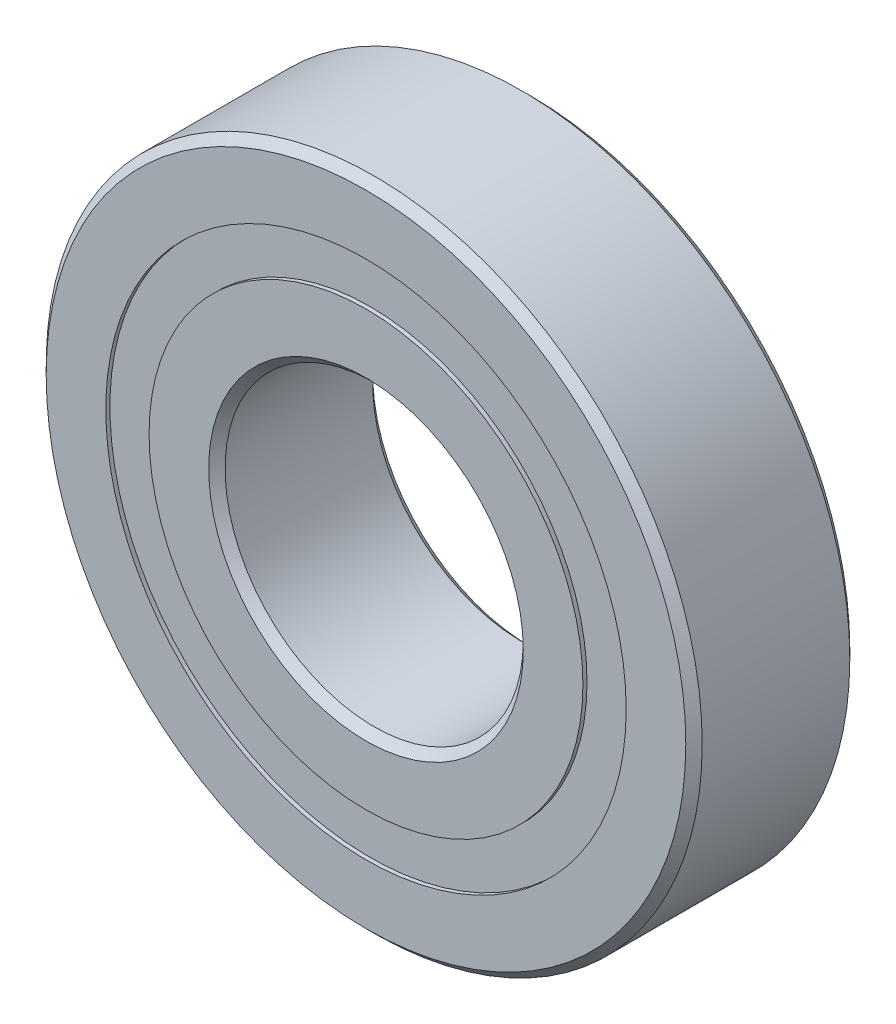
ISO-10303-21;
HEADER;
FILE_DESCRIPTION(('STEP AP214'),'2;1');
FILE_NAME('part.step','',(''),(''),'','','');
FILE_SCHEMA(('AUTOMOTIVE_DESIGN { 1 0 10303 214 1 1 1 1 }'));
ENDSEC;
DATA;
#1=APPLICATION_CONTEXT('core data for automotive mechanical design processes');
#2=APPLICATION_PROTOCOL_DEFINITION('international standard','automotive_design',2000,#1);
#3=PRODUCT_CONTEXT('',#1,'mechanical');
#4=PRODUCT('Part','Part','',(#3));
#5=PRODUCT_RELATED_PRODUCT_CATEGORY('part','',(#4));
#6=PRODUCT_DEFINITION_FORMATION('','',#4);
#7=PRODUCT_DEFINITION_CONTEXT('part definition',#1,'design');
#8=PRODUCT_DEFINITION('design','',#6,#7);
#9=PRODUCT_DEFINITION_SHAPE('','',#8);
#10=(LENGTH_UNIT() NAMED_UNIT(*) SI_UNIT(.MILLI.,.METRE.));
#11=(NAMED_UNIT(*) PLANE_ANGLE_UNIT() SI_UNIT($,.RADIAN.));
#12=(NAMED_UNIT(*) SI_UNIT($,.STERADIAN.) SOLID_ANGLE_UNIT());
#13=UNCERTAINTY_MEASURE_WITH_UNIT(LENGTH_MEASURE(1.E-05),#10,'distance_accuracy_value','');
#14=(GEOMETRIC_REPRESENTATION_CONTEXT(3) GLOBAL_UNCERTAINTY_ASSIGNED_CONTEXT((#13)) GLOBAL_UNIT_ASSIGNED_CONTEXT((#10,
#11,#12)) REPRESENTATION_CONTEXT('',''));
#15=CARTESIAN_POINT('',(0.,0.,0.));
#16=DIRECTION('',(0.,0.,1.));
#17=DIRECTION('',(1.,0.,0.));
#18=AXIS2_PLACEMENT_3D('',#15,#16,#17);
#19=CARTESIAN_POINT('',(0.,13.8513736263736,-4.14734375000003));
#20=DIRECTION('',(0.,0.,1.));
#21=DIRECTION('',(1.,0.,0.));
#22=AXIS2_PLACEMENT_3D('',#19,#20,#21);
#23=PLANE('',#22);
#24=CARTESIAN_POINT('',(0.,0.,-4.14734375000003));
#25=DIRECTION('',(0.,0.,1.));
#26=DIRECTION('',(1.,0.,0.));
#27=AXIS2_PLACEMENT_3D('',#24,#25,#26);
#28=CIRCLE('',#27,13.8513736263736);
#29=CARTESIAN_POINT('',(13.8513736263736,0.,-4.14734375000003));
#30=VERTEX_POINT('',#29);
#31=EDGE_CURVE('E63',#30,#30,#28,.T.);
#32=ORIENTED_EDGE('',*,*,#31,.F.);
#33=EDGE_LOOP('',(#32));
#34=FACE_BOUND('',#33,.T.);
#35=CARTESIAN_POINT('',(0.,0.,-4.14734375000003));
#36=DIRECTION('',(0.,0.,1.));
#37=DIRECTION('',(1.,0.,0.));
#38=AXIS2_PLACEMENT_3D('',#35,#36,#37);
#39=CIRCLE('',#38,11.5486263736264);
#40=CARTESIAN_POINT('',(11.5486263736264,0.,-4.14734375000003));
#41=VERTEX_POINT('',#40);
#42=EDGE_CURVE('E11',#41,#41,#39,.T.);
#43=ORIENTED_EDGE('',*,*,#42,.T.);
#44=EDGE_LOOP('',(#43));
#45=FACE_BOUND('',#44,.T.);
#46=ADVANCED_FACE('F49',(#34,#45),#23,.F.);
#47=CARTESIAN_POINT('',(0.,0.,4.36562500000004));
#48=DIRECTION('',(0.,0.,1.));
#49=DIRECTION('',(1.,0.,0.));
#50=AXIS2_PLACEMENT_3D('',#47,#48,#49);
#51=CYLINDRICAL_SURFACE('',#50,11.5486263736264);
#52=ORIENTED_EDGE('',*,*,#42,.F.);
#53=EDGE_LOOP('',(#52));
#54=FACE_BOUND('',#53,.T.);
#55=CARTESIAN_POINT('',(0.,0.,-2.25617798111033));
#56=DIRECTION('',(0.,0.,1.));
#57=DIRECTION('',(1.,0.,0.));
#58=AXIS2_PLACEMENT_3D('',#55,#56,#57);
#59=CIRCLE('',#58,11.5486263736264);
#60=CARTESIAN_POINT('',(11.5486263736264,0.,-2.25617798111033));
#61=VERTEX_POINT('',#60);
#62=EDGE_CURVE('E55',#61,#61,#59,.T.);
#63=ORIENTED_EDGE('',*,*,#62,.T.);
#64=EDGE_LOOP('',(#63));
#65=FACE_BOUND('',#64,.T.);
#66=ADVANCED_FACE('F72',(#54,#65),#51,.F.);
#67=CARTESIAN_POINT('',(0.,13.8513736263736,-2.25617798111033));
#68=DIRECTION('',(0.,0.,-1.));
#69=DIRECTION('',(-1.,0.,0.));
#70=AXIS2_PLACEMENT_3D('',#67,#68,#69);
#71=PLANE('',#70);
#72=ORIENTED_EDGE('',*,*,#62,.F.);
#73=EDGE_LOOP('',(#72));
#74=FACE_BOUND('',#73,.T.);
#75=CARTESIAN_POINT('',(0.,0.,-2.25617798111033));
#76=DIRECTION('',(0.,0.,1.));
#77=DIRECTION('',(1.,0.,0.));
#78=AXIS2_PLACEMENT_3D('',#75,#76,#77);
#79=CIRCLE('',#78,13.8513736263736);
#80=CARTESIAN_POINT('',(13.8513736263736,0.,-2.25617798111033));
#81=VERTEX_POINT('',#80);
#82=EDGE_CURVE('E59',#81,#81,#79,.T.);
#83=ORIENTED_EDGE('',*,*,#82,.T.);
#84=EDGE_LOOP('',(#83));
#85=FACE_BOUND('',#84,.T.);
#86=ADVANCED_FACE('F76',(#74,#85),#71,.F.);
#87=CARTESIAN_POINT('',(0.,0.,4.36562500000004));
#88=DIRECTION('',(0.,0.,1.));
#89=DIRECTION('',(1.,0.,0.));
#90=AXIS2_PLACEMENT_3D('',#87,#88,#89);
#91=CYLINDRICAL_SURFACE('',#90,13.8513736263736);
#92=ORIENTED_EDGE('',*,*,#82,.F.);
#93=EDGE_LOOP('',(#92));
#94=FACE_BOUND('',#93,.T.);
#95=ORIENTED_EDGE('',*,*,#31,.T.);
#96=EDGE_LOOP('',(#95));
#97=FACE_BOUND('',#96,.T.);
#98=ADVANCED_FACE('F69',(#94,#97),#91,.T.);
#99=CLOSED_SHELL('',(#46,#66,#86,#98));
#100=MANIFOLD_SOLID_BREP('B2',#99);
#101=CARTESIAN_POINT('',(0.,13.8513736263736,4.14734375000003));
#102=DIRECTION('',(0.,0.,-1.));
#103=DIRECTION('',(-1.,0.,0.));
#104=AXIS2_PLACEMENT_3D('',#101,#102,#103);
#105=PLANE('',#104);
#106=CARTESIAN_POINT('',(0.,0.,4.14734375000003));
#107=DIRECTION('',(0.,0.,1.));
#108=DIRECTION('',(1.,0.,0.));
#109=AXIS2_PLACEMENT_3D('',#106,#107,#108);
#110=CIRCLE('',#109,11.5486263736264);
#111=CARTESIAN_POINT('',(11.5486263736264,0.,4.14734375000003));
#112=VERTEX_POINT('',#111);
#113=EDGE_CURVE('E48',#112,#112,#110,.T.);
#114=ORIENTED_EDGE('',*,*,#113,.F.);
#115=EDGE_LOOP('',(#114));
#116=FACE_BOUND('',#115,.T.);
#117=CARTESIAN_POINT('',(0.,0.,4.14734375000003));
#118=DIRECTION('',(0.,0.,1.));
#119=DIRECTION('',(1.,0.,0.));
#120=AXIS2_PLACEMENT_3D('',#117,#118,#119);
#121=CIRCLE('',#120,13.8513736263736);
#122=CARTESIAN_POINT('',(13.8513736263736,0.,4.14734375000003));
#123=VERTEX_POINT('',#122);
#124=EDGE_CURVE('E128',#123,#123,#121,.T.);
#125=ORIENTED_EDGE('',*,*,#124,.T.);
#126=EDGE_LOOP('',(#125));
#127=FACE_BOUND('',#126,.T.);
#128=ADVANCED_FACE('F114',(#116,#127),#105,.F.);
#129=CARTESIAN_POINT('',(0.,0.,4.36562500000004));
#130=DIRECTION('',(0.,0.,1.));
#131=DIRECTION('',(1.,0.,0.));
#132=AXIS2_PLACEMENT_3D('',#129,#130,#131);
#133=CYLINDRICAL_SURFACE('',#132,11.5486263736264);
#134=CARTESIAN_POINT('',(0.,0.,2.25617798111033));
#135=DIRECTION('',(0.,0.,1.));
#136=DIRECTION('',(1.,0.,0.));
#137=AXIS2_PLACEMENT_3D('',#134,#135,#136);
#138=CIRCLE('',#137,11.5486263736264);
#139=CARTESIAN_POINT('',(11.5486263736264,0.,2.25617798111033));
#140=VERTEX_POINT('',#139);
#141=EDGE_CURVE('E120',#140,#140,#138,.T.);
#142=ORIENTED_EDGE('',*,*,#141,.F.);
#143=EDGE_LOOP('',(#142));
#144=FACE_BOUND('',#143,.T.);
#145=ORIENTED_EDGE('',*,*,#113,.T.);
#146=EDGE_LOOP('',(#145));
#147=FACE_BOUND('',#146,.T.);
#148=ADVANCED_FACE('F143',(#144,#147),#133,.F.);
#149=CARTESIAN_POINT('',(0.,13.8513736263736,2.25617798111033));
#150=DIRECTION('',(0.,0.,1.));
#151=DIRECTION('',(1.,0.,0.));
#152=AXIS2_PLACEMENT_3D('',#149,#150,#151);
#153=PLANE('',#152);
#154=CARTESIAN_POINT('',(0.,0.,2.25617798111033));
#155=DIRECTION('',(0.,0.,1.));
#156=DIRECTION('',(1.,0.,0.));
#157=AXIS2_PLACEMENT_3D('',#154,#155,#156);
#158=CIRCLE('',#157,13.8513736263736);
#159=CARTESIAN_POINT('',(13.8513736263736,0.,2.25617798111033));
#160=VERTEX_POINT('',#159);
#161=EDGE_CURVE('E124',#160,#160,#158,.T.);
#162=ORIENTED_EDGE('',*,*,#161,.F.);
#163=EDGE_LOOP('',(#162));
#164=FACE_BOUND('',#163,.T.);
#165=ORIENTED_EDGE('',*,*,#141,.T.);
#166=EDGE_LOOP('',(#165));
#167=FACE_BOUND('',#166,.T.);
#168=ADVANCED_FACE('F138',(#164,#167),#153,.F.);
#169=CARTESIAN_POINT('',(0.,0.,4.36562500000004));
#170=DIRECTION('',(0.,0.,1.));
#171=DIRECTION('',(1.,0.,0.));
#172=AXIS2_PLACEMENT_3D('',#169,#170,#171);
#173=CYLINDRICAL_SURFACE('',#172,13.8513736263736);
#174=ORIENTED_EDGE('',*,*,#124,.F.);
#175=EDGE_LOOP('',(#174));
#176=FACE_BOUND('',#175,.T.);
#177=ORIENTED_EDGE('',*,*,#161,.T.);
#178=EDGE_LOOP('',(#177));
#179=FACE_BOUND('',#178,.T.);
#180=ADVANCED_FACE('F135',(#176,#179),#173,.T.);
#181=CLOSED_SHELL('',(#128,#148,#168,#180));
#182=MANIFOLD_SOLID_BREP('B6',#181);
#183=CARTESIAN_POINT('',(-7.46487270411428,10.2745158285619,0.));
#184=DIRECTION('',(0.,0.,1.));
#185=DIRECTION('',(-0.587785252292463,0.809016994374956,0.));
#186=AXIS2_PLACEMENT_3D('',#183,#184,#185);
#187=SPHERICAL_SURFACE('',#186,2.25617798111032);
#188=CARTESIAN_POINT('',(-7.46487270411428,10.2745158285619,2.25617798111032));
#189=VERTEX_POINT('',#188);
#190=VERTEX_LOOP('',#189);
#191=FACE_BOUND('',#190,.T.);
#192=ADVANCED_FACE('F173',(#191),#187,.T.);
#193=CLOSED_SHELL('',(#192));
#194=MANIFOLD_SOLID_BREP('B43',#193);
#195=CARTESIAN_POINT('',(-12.0784177569484,3.92451582856197,0.));
#196=DIRECTION('',(0.,0.,1.));
#197=DIRECTION('',(-0.951056516295151,0.309016994374959,0.));
#198=AXIS2_PLACEMENT_3D('',#195,#196,#197);
#199=SPHERICAL_SURFACE('',#198,2.25617798111032);
#200=CARTESIAN_POINT('',(-12.0784177569484,3.92451582856197,2.25617798111032));
#201=VERTEX_POINT('',#200);
#202=VERTEX_LOOP('',#201);
#203=FACE_BOUND('',#202,.T.);
#204=ADVANCED_FACE('F191',(#203),#199,.T.);
#205=CLOSED_SHELL('',(#204));
#206=MANIFOLD_SOLID_BREP('B110',#205);
#207=CARTESIAN_POINT('',(-12.0784177569485,-3.92451582856172,0.));
#208=DIRECTION('',(0.,0.,1.));
#209=DIRECTION('',(-0.951056516295158,-0.309016994374939,0.));
#210=AXIS2_PLACEMENT_3D('',#207,#208,#209);
#211=SPHERICAL_SURFACE('',#210,2.25617798111032);
#212=CARTESIAN_POINT('',(-12.0784177569485,-3.92451582856172,2.25617798111032));
#213=VERTEX_POINT('',#212);
#214=VERTEX_LOOP('',#213);
#215=FACE_BOUND('',#214,.T.);
#216=ADVANCED_FACE('F209',(#215),#211,.T.);
#217=CLOSED_SHELL('',(#216));
#218=MANIFOLD_SOLID_BREP('B169',#217);
#219=CARTESIAN_POINT('',(-7.4648727041145,-10.2745158285618,0.));
#220=DIRECTION('',(0.,0.,1.));
#221=DIRECTION('',(-0.587785252292481,-0.809016994374944,0.));
#222=AXIS2_PLACEMENT_3D('',#219,#220,#221);
#223=SPHERICAL_SURFACE('',#222,2.25617798111032);
#224=CARTESIAN_POINT('',(-7.4648727041145,-10.2745158285618,2.25617798111032));
#225=VERTEX_POINT('',#224);
#226=VERTEX_LOOP('',#225);
#227=FACE_BOUND('',#226,.T.);
#228=ADVANCED_FACE('F227',(#227),#223,.T.);
#229=CLOSED_SHELL('',(#228));
#230=MANIFOLD_SOLID_BREP('B187',#229);
#231=CARTESIAN_POINT('',(-1.11022302462516E-13,-12.7,0.));
#232=DIRECTION('',(0.,0.,1.));
#233=DIRECTION('',(0.,-1.,0.));
#234=AXIS2_PLACEMENT_3D('',#231,#232,#233);
#235=SPHERICAL_SURFACE('',#234,2.25617798111032);
#236=CARTESIAN_POINT('',(-1.11022302462516E-13,-12.7,2.25617798111032));
#237=VERTEX_POINT('',#236);
#238=VERTEX_LOOP('',#237);
#239=FACE_BOUND('',#238,.T.);
#240=ADVANCED_FACE('F245',(#239),#235,.T.);
#241=CLOSED_SHELL('',(#240));
#242=MANIFOLD_SOLID_BREP('B205',#241);
#243=CARTESIAN_POINT('',(7.46487270411433,-10.2745158285619,0.));
#244=DIRECTION('',(0.,0.,1.));
#245=DIRECTION('',(0.587785252292469,-0.809016994374952,0.));
#246=AXIS2_PLACEMENT_3D('',#243,#244,#245);
#247=SPHERICAL_SURFACE('',#246,2.25617798111032);
#248=CARTESIAN_POINT('',(7.46487270411433,-10.2745158285619,2.25617798111032));
#249=VERTEX_POINT('',#248);
#250=VERTEX_LOOP('',#249);
#251=FACE_BOUND('',#250,.T.);
#252=ADVANCED_FACE('F263',(#251),#247,.T.);
#253=CLOSED_SHELL('',(#252));
#254=MANIFOLD_SOLID_BREP('B223',#253);
#255=CARTESIAN_POINT('',(12.0784177569485,-3.92451582856188,0.));
#256=DIRECTION('',(0.,0.,1.));
#257=DIRECTION('',(0.951056516295154,-0.309016994374952,0.));
#258=AXIS2_PLACEMENT_3D('',#255,#256,#257);
#259=SPHERICAL_SURFACE('',#258,2.25617798111032);
#260=CARTESIAN_POINT('',(12.0784177569485,-3.92451582856188,2.25617798111032));
#261=VERTEX_POINT('',#260);
#262=VERTEX_LOOP('',#261);
#263=FACE_BOUND('',#262,.T.);
#264=ADVANCED_FACE('F281',(#263),#259,.T.);
#265=CLOSED_SHELL('',(#264));
#266=MANIFOLD_SOLID_BREP('B241',#265);
#267=CARTESIAN_POINT('',(12.0784177569485,3.9245158285618,0.));
#268=DIRECTION('',(0.,0.,1.));
#269=DIRECTION('',(0.951056516295156,0.309016994374945,0.));
#270=AXIS2_PLACEMENT_3D('',#267,#268,#269);
#271=SPHERICAL_SURFACE('',#270,2.25617798111032);
#272=CARTESIAN_POINT('',(12.0784177569485,3.9245158285618,2.25617798111032));
#273=VERTEX_POINT('',#272);
#274=VERTEX_LOOP('',#273);
#275=FACE_BOUND('',#274,.T.);
#276=ADVANCED_FACE('F299',(#275),#271,.T.);
#277=CLOSED_SHELL('',(#276));
#278=MANIFOLD_SOLID_BREP('B259',#277);
#279=CARTESIAN_POINT('',(7.46487270411444,10.2745158285618,0.));
#280=DIRECTION('',(0.,0.,1.));
#281=DIRECTION('',(0.587785252292475,0.809016994374948,0.));
#282=AXIS2_PLACEMENT_3D('',#279,#280,#281);
#283=SPHERICAL_SURFACE('',#282,2.25617798111032);
#284=CARTESIAN_POINT('',(7.46487270411444,10.2745158285618,2.25617798111032));
#285=VERTEX_POINT('',#284);
#286=VERTEX_LOOP('',#285);
#287=FACE_BOUND('',#286,.T.);
#288=ADVANCED_FACE('F317',(#287),#283,.T.);
#289=CLOSED_SHELL('',(#288));
#290=MANIFOLD_SOLID_BREP('B277',#289);
#291=CARTESIAN_POINT('',(0.,12.7,0.));
#292=DIRECTION('',(0.,0.,1.));
#293=DIRECTION('',(0.,1.,0.));
#294=AXIS2_PLACEMENT_3D('',#291,#292,#293);
#295=SPHERICAL_SURFACE('',#294,2.25617798111032);
#296=CARTESIAN_POINT('',(0.,12.7,2.25617798111032));
#297=VERTEX_POINT('',#296);
#298=VERTEX_LOOP('',#297);
#299=FACE_BOUND('',#298,.T.);
#300=ADVANCED_FACE('F339',(#299),#295,.T.);
#301=CLOSED_SHELL('',(#300));
#302=MANIFOLD_SOLID_BREP('B295',#301);
#303=CARTESIAN_POINT('',(0.,11.5486263736264,4.36562500000004));
#304=DIRECTION('',(0.,0.,-1.));
#305=DIRECTION('',(-1.,0.,0.));
#306=AXIS2_PLACEMENT_3D('',#303,#304,#305);
#307=PLANE('',#306);
#308=CARTESIAN_POINT('',(0.,0.,4.36562500000004));
#309=DIRECTION('',(0.,0.,1.));
#310=DIRECTION('',(1.,0.,0.));
#311=AXIS2_PLACEMENT_3D('',#308,#309,#310);
#312=CIRCLE('',#311,8.3740625);
#313=CARTESIAN_POINT('',(8.37406250000001,0.,4.36562500000004));
#314=VERTEX_POINT('',#313);
#315=EDGE_CURVE('E392',#314,#314,#312,.T.);
#316=ORIENTED_EDGE('',*,*,#315,.F.);
#317=EDGE_LOOP('',(#316));
#318=FACE_BOUND('',#317,.T.);
#319=CARTESIAN_POINT('',(0.,0.,4.36562500000004));
#320=DIRECTION('',(0.,0.,1.));
#321=DIRECTION('',(1.,0.,0.));
#322=AXIS2_PLACEMENT_3D('',#319,#320,#321);
#323=CIRCLE('',#322,11.5486263736264);
#324=CARTESIAN_POINT('',(11.5486263736264,0.,4.36562500000004));
#325=VERTEX_POINT('',#324);
#326=EDGE_CURVE('E338',#325,#325,#323,.T.);
#327=ORIENTED_EDGE('',*,*,#326,.T.);
#328=EDGE_LOOP('',(#327));
#329=FACE_BOUND('',#328,.T.);
#330=ADVANCED_FACE('F364',(#318,#329),#307,.F.);
#331=CARTESIAN_POINT('',(0.,0.,4.36562500000004));
#332=DIRECTION('',(0.,0.,1.));
#333=DIRECTION('',(1.,0.,0.));
#334=AXIS2_PLACEMENT_3D('',#331,#332,#333);
#335=CYLINDRICAL_SURFACE('',#334,11.5486263736264);
#336=ORIENTED_EDGE('',*,*,#326,.F.);
#337=EDGE_LOOP('',(#336));
#338=FACE_BOUND('',#337,.T.);
#339=CARTESIAN_POINT('',(0.,0.,1.94027777777783));
#340=DIRECTION('',(0.,0.,1.));
#341=DIRECTION('',(1.,0.,0.));
#342=AXIS2_PLACEMENT_3D('',#339,#340,#341);
#343=CIRCLE('',#342,11.5486263736264);
#344=CARTESIAN_POINT('',(11.5486263736264,0.,1.94027777777783));
#345=VERTEX_POINT('',#344);
#346=EDGE_CURVE('E370',#345,#345,#343,.T.);
#347=ORIENTED_EDGE('',*,*,#346,.T.);
#348=EDGE_LOOP('',(#347));
#349=FACE_BOUND('',#348,.T.);
#350=ADVANCED_FACE('F399',(#338,#349),#335,.T.);
#351=CARTESIAN_POINT('',(0.,0.,0.));
#352=DIRECTION('',(0.,0.,1.));
#353=DIRECTION('',(1.,0.,0.));
#354=AXIS2_PLACEMENT_3D('',#351,#352,#353);
#355=TOROIDAL_SURFACE('',#354,12.7,2.25617798111031);
#356=ORIENTED_EDGE('',*,*,#346,.F.);
#357=EDGE_LOOP('',(#356));
#358=FACE_BOUND('',#357,.T.);
#359=CARTESIAN_POINT('',(0.,0.,-1.94027777777783));
#360=DIRECTION('',(0.,0.,1.));
#361=DIRECTION('',(1.,0.,0.));
#362=AXIS2_PLACEMENT_3D('',#359,#360,#361);
#363=CIRCLE('',#362,11.5486263736264);
#364=CARTESIAN_POINT('',(11.5486263736264,0.,-1.94027777777783));
#365=VERTEX_POINT('',#364);
#366=EDGE_CURVE('E374',#365,#365,#363,.T.);
#367=ORIENTED_EDGE('',*,*,#366,.T.);
#368=EDGE_LOOP('',(#367));
#369=FACE_BOUND('',#368,.T.);
#370=ADVANCED_FACE('F403',(#358,#369),#355,.F.);
#371=CARTESIAN_POINT('',(0.,0.,4.36562500000004));
#372=DIRECTION('',(0.,0.,1.));
#373=DIRECTION('',(1.,0.,0.));
#374=AXIS2_PLACEMENT_3D('',#371,#372,#373);
#375=CYLINDRICAL_SURFACE('',#374,11.5486263736264);
#376=ORIENTED_EDGE('',*,*,#366,.F.);
#377=EDGE_LOOP('',(#376));
#378=FACE_BOUND('',#377,.T.);
#379=CARTESIAN_POINT('',(0.,0.,-4.36562500000004));
#380=DIRECTION('',(0.,0.,1.));
#381=DIRECTION('',(1.,0.,0.));
#382=AXIS2_PLACEMENT_3D('',#379,#380,#381);
#383=CIRCLE('',#382,11.5486263736264);
#384=CARTESIAN_POINT('',(11.5486263736264,0.,-4.36562500000004));
#385=VERTEX_POINT('',#384);
#386=EDGE_CURVE('E378',#385,#385,#383,.T.);
#387=ORIENTED_EDGE('',*,*,#386,.T.);
#388=EDGE_LOOP('',(#387));
#389=FACE_BOUND('',#388,.T.);
#390=ADVANCED_FACE('F408',(#378,#389),#375,.T.);
#391=CARTESIAN_POINT('',(0.,8.3740625,-4.36562500000004));
#392=DIRECTION('',(0.,0.,1.));
#393=DIRECTION('',(1.,0.,0.));
#394=AXIS2_PLACEMENT_3D('',#391,#392,#393);
#395=PLANE('',#394);
#396=ORIENTED_EDGE('',*,*,#386,.F.);
#397=EDGE_LOOP('',(#396));
#398=FACE_BOUND('',#397,.T.);
#399=CARTESIAN_POINT('',(0.,0.,-4.36562500000004));
#400=DIRECTION('',(0.,0.,1.));
#401=DIRECTION('',(1.,0.,0.));
#402=AXIS2_PLACEMENT_3D('',#399,#400,#401);
#403=CIRCLE('',#402,8.3740625);
#404=CARTESIAN_POINT('',(8.37406250000001,0.,-4.36562500000004));
#405=VERTEX_POINT('',#404);
#406=EDGE_CURVE('E383',#405,#405,#403,.T.);
#407=ORIENTED_EDGE('',*,*,#406,.T.);
#408=EDGE_LOOP('',(#407));
#409=FACE_BOUND('',#408,.T.);
#410=ADVANCED_FACE('F414',(#398,#409),#395,.F.);
#411=CARTESIAN_POINT('',(0.,0.,-3.92906250000002));
#412=DIRECTION('',(0.,0.,-1.));
#413=DIRECTION('',(-1.,0.,0.));
#414=AXIS2_PLACEMENT_3D('',#411,#412,#413);
#415=CONICAL_SURFACE('',#414,7.9375,0.785398163397448);
#416=ORIENTED_EDGE('',*,*,#406,.F.);
#417=EDGE_LOOP('',(#416));
#418=FACE_BOUND('',#417,.T.);
#419=CARTESIAN_POINT('',(0.,0.,-3.92906250000002));
#420=DIRECTION('',(0.,0.,1.));
#421=DIRECTION('',(1.,0.,0.));
#422=AXIS2_PLACEMENT_3D('',#419,#420,#421);
#423=CIRCLE('',#422,7.9375);
#424=CARTESIAN_POINT('',(7.93750000000001,0.,-3.92906250000002));
#425=VERTEX_POINT('',#424);
#426=EDGE_CURVE('E386',#425,#425,#423,.T.);
#427=ORIENTED_EDGE('',*,*,#426,.T.);
#428=EDGE_LOOP('',(#427));
#429=FACE_BOUND('',#428,.T.);
#430=ADVANCED_FACE('F418',(#418,#429),#415,.F.);
#431=CARTESIAN_POINT('',(0.,0.,4.36562500000004));
#432=DIRECTION('',(0.,0.,1.));
#433=DIRECTION('',(1.,0.,0.));
#434=AXIS2_PLACEMENT_3D('',#431,#432,#433);
#435=CYLINDRICAL_SURFACE('',#434,7.9375);
#436=ORIENTED_EDGE('',*,*,#426,.F.);
#437=EDGE_LOOP('',(#436));
#438=FACE_BOUND('',#437,.T.);
#439=CARTESIAN_POINT('',(0.,0.,3.92906250000002));
#440=DIRECTION('',(0.,0.,1.));
#441=DIRECTION('',(1.,0.,0.));
#442=AXIS2_PLACEMENT_3D('',#439,#440,#441);
#443=CIRCLE('',#442,7.9375);
#444=CARTESIAN_POINT('',(7.93750000000001,0.,3.92906250000002));
#445=VERTEX_POINT('',#444);
#446=EDGE_CURVE('E389',#445,#445,#443,.T.);
#447=ORIENTED_EDGE('',*,*,#446,.T.);
#448=EDGE_LOOP('',(#447));
#449=FACE_BOUND('',#448,.T.);
#450=ADVANCED_FACE('F422',(#438,#449),#435,.F.);
#451=CARTESIAN_POINT('',(0.,0.,4.36562500000004));
#452=DIRECTION('',(0.,0.,1.));
#453=DIRECTION('',(1.,0.,0.));
#454=AXIS2_PLACEMENT_3D('',#451,#452,#453);
#455=CONICAL_SURFACE('',#454,8.3740625,0.785398163397446);
#456=ORIENTED_EDGE('',*,*,#446,.F.);
#457=EDGE_LOOP('',(#456));
#458=FACE_BOUND('',#457,.T.);
#459=ORIENTED_EDGE('',*,*,#315,.T.);
#460=EDGE_LOOP('',(#459));
#461=FACE_BOUND('',#460,.T.);
#462=ADVANCED_FACE('F396',(#458,#461),#455,.F.);
#463=CLOSED_SHELL('',(#330,#350,#370,#390,#410,#430,#450,#462));
#464=MANIFOLD_SOLID_BREP('B313',#463);
#465=CARTESIAN_POINT('',(0.,0.,3.92906250000002));
#466=DIRECTION('',(0.,0.,-1.));
#467=DIRECTION('',(-1.,0.,0.));
#468=AXIS2_PLACEMENT_3D('',#465,#466,#467);
#469=CONICAL_SURFACE('',#468,17.4625,0.785398163397449);
#470=CARTESIAN_POINT('',(0.,0.,4.36562500000004));
#471=DIRECTION('',(0.,0.,1.));
#472=DIRECTION('',(1.,0.,0.));
#473=AXIS2_PLACEMENT_3D('',#470,#471,#472);
#474=CIRCLE('',#473,17.0259375);
#475=CARTESIAN_POINT('',(17.0259375,0.,4.36562500000004));
#476=VERTEX_POINT('',#475);
#477=EDGE_CURVE('E503',#476,#476,#474,.T.);
#478=ORIENTED_EDGE('',*,*,#477,.F.);
#479=EDGE_LOOP('',(#478));
#480=FACE_BOUND('',#479,.T.);
#481=CARTESIAN_POINT('',(0.,0.,3.92906250000002));
#482=DIRECTION('',(0.,0.,1.));
#483=DIRECTION('',(1.,0.,0.));
#484=AXIS2_PLACEMENT_3D('',#481,#482,#483);
#485=CIRCLE('',#484,17.4625);
#486=CARTESIAN_POINT('',(17.4625,0.,3.92906250000002));
#487=VERTEX_POINT('',#486);
#488=EDGE_CURVE('E363',#487,#487,#485,.T.);
#489=ORIENTED_EDGE('',*,*,#488,.T.);
#490=EDGE_LOOP('',(#489));
#491=FACE_BOUND('',#490,.T.);
#492=ADVANCED_FACE('F475',(#480,#491),#469,.T.);
#493=CARTESIAN_POINT('',(0.,0.,4.36562500000004));
#494=DIRECTION('',(0.,0.,1.));
#495=DIRECTION('',(1.,0.,0.));
#496=AXIS2_PLACEMENT_3D('',#493,#494,#495);
#497=CYLINDRICAL_SURFACE('',#496,17.4625);
#498=ORIENTED_EDGE('',*,*,#488,.F.);
#499=EDGE_LOOP('',(#498));
#500=FACE_BOUND('',#499,.T.);
#501=CARTESIAN_POINT('',(0.,0.,-3.92906250000002));
#502=DIRECTION('',(0.,0.,1.));
#503=DIRECTION('',(1.,0.,0.));
#504=AXIS2_PLACEMENT_3D('',#501,#502,#503);
#505=CIRCLE('',#504,17.4625);
#506=CARTESIAN_POINT('',(17.4625,0.,-3.92906250000002));
#507=VERTEX_POINT('',#506);
#508=EDGE_CURVE('E481',#507,#507,#505,.T.);
#509=ORIENTED_EDGE('',*,*,#508,.T.);
#510=EDGE_LOOP('',(#509));
#511=FACE_BOUND('',#510,.T.);
#512=ADVANCED_FACE('F510',(#500,#511),#497,.T.);
#513=CARTESIAN_POINT('',(0.,0.,-4.36562500000004));
#514=DIRECTION('',(0.,0.,1.));
#515=DIRECTION('',(1.,0.,0.));
#516=AXIS2_PLACEMENT_3D('',#513,#514,#515);
#517=CONICAL_SURFACE('',#516,17.0259375,0.78539816339745);
#518=ORIENTED_EDGE('',*,*,#508,.F.);
#519=EDGE_LOOP('',(#518));
#520=FACE_BOUND('',#519,.T.);
#521=CARTESIAN_POINT('',(0.,0.,-4.36562500000004));
#522=DIRECTION('',(0.,0.,1.));
#523=DIRECTION('',(1.,0.,0.));
#524=AXIS2_PLACEMENT_3D('',#521,#522,#523);
#525=CIRCLE('',#524,17.0259375);
#526=CARTESIAN_POINT('',(17.0259375,0.,-4.36562500000004));
#527=VERTEX_POINT('',#526);
#528=EDGE_CURVE('E485',#527,#527,#525,.T.);
#529=ORIENTED_EDGE('',*,*,#528,.T.);
#530=EDGE_LOOP('',(#529));
#531=FACE_BOUND('',#530,.T.);
#532=ADVANCED_FACE('F514',(#520,#531),#517,.T.);
#533=CARTESIAN_POINT('',(0.,17.0259375,-4.36562500000004));
#534=DIRECTION('',(0.,0.,1.));
#535=DIRECTION('',(1.,0.,0.));
#536=AXIS2_PLACEMENT_3D('',#533,#534,#535);
#537=PLANE('',#536);
#538=ORIENTED_EDGE('',*,*,#528,.F.);
#539=EDGE_LOOP('',(#538));
#540=FACE_BOUND('',#539,.T.);
#541=CARTESIAN_POINT('',(0.,0.,-4.36562500000004));
#542=DIRECTION('',(0.,0.,1.));
#543=DIRECTION('',(1.,0.,0.));
#544=AXIS2_PLACEMENT_3D('',#541,#542,#543);
#545=CIRCLE('',#544,13.8513736263736);
#546=CARTESIAN_POINT('',(13.8513736263736,0.,-4.36562500000004));
#547=VERTEX_POINT('',#546);
#548=EDGE_CURVE('E489',#547,#547,#545,.T.);
#549=ORIENTED_EDGE('',*,*,#548,.T.);
#550=EDGE_LOOP('',(#549));
#551=FACE_BOUND('',#550,.T.);
#552=ADVANCED_FACE('F519',(#540,#551),#537,.F.);
#553=CARTESIAN_POINT('',(0.,0.,4.36562500000004));
#554=DIRECTION('',(0.,0.,1.));
#555=DIRECTION('',(1.,0.,0.));
#556=AXIS2_PLACEMENT_3D('',#553,#554,#555);
#557=CYLINDRICAL_SURFACE('',#556,13.8513736263736);
#558=ORIENTED_EDGE('',*,*,#548,.F.);
#559=EDGE_LOOP('',(#558));
#560=FACE_BOUND('',#559,.T.);
#561=CARTESIAN_POINT('',(0.,0.,-1.94027777777783));
#562=DIRECTION('',(0.,0.,1.));
#563=DIRECTION('',(1.,0.,0.));
#564=AXIS2_PLACEMENT_3D('',#561,#562,#563);
#565=CIRCLE('',#564,13.8513736263736);
#566=CARTESIAN_POINT('',(13.8513736263736,0.,-1.94027777777783));
#567=VERTEX_POINT('',#566);
#568=EDGE_CURVE('E494',#567,#567,#565,.T.);
#569=ORIENTED_EDGE('',*,*,#568,.T.);
#570=EDGE_LOOP('',(#569));
#571=FACE_BOUND('',#570,.T.);
#572=ADVANCED_FACE('F525',(#560,#571),#557,.F.);
#573=CARTESIAN_POINT('',(0.,0.,0.));
#574=DIRECTION('',(0.,0.,1.));
#575=DIRECTION('',(1.,0.,0.));
#576=AXIS2_PLACEMENT_3D('',#573,#574,#575);
#577=TOROIDAL_SURFACE('',#576,12.7,2.25617798111032);
#578=ORIENTED_EDGE('',*,*,#568,.F.);
#579=EDGE_LOOP('',(#578));
#580=FACE_BOUND('',#579,.T.);
#581=CARTESIAN_POINT('',(0.,0.,1.94027777777783));
#582=DIRECTION('',(0.,0.,1.));
#583=DIRECTION('',(1.,0.,0.));
#584=AXIS2_PLACEMENT_3D('',#581,#582,#583);
#585=CIRCLE('',#584,13.8513736263736);
#586=CARTESIAN_POINT('',(13.8513736263736,0.,1.94027777777783));
#587=VERTEX_POINT('',#586);
#588=EDGE_CURVE('E497',#587,#587,#585,.T.);
#589=ORIENTED_EDGE('',*,*,#588,.T.);
#590=EDGE_LOOP('',(#589));
#591=FACE_BOUND('',#590,.T.);
#592=ADVANCED_FACE('F529',(#580,#591),#577,.F.);
#593=CARTESIAN_POINT('',(0.,0.,4.36562500000004));
#594=DIRECTION('',(0.,0.,1.));
#595=DIRECTION('',(1.,0.,0.));
#596=AXIS2_PLACEMENT_3D('',#593,#594,#595);
#597=CYLINDRICAL_SURFACE('',#596,13.8513736263736);
#598=ORIENTED_EDGE('',*,*,#588,.F.);
#599=EDGE_LOOP('',(#598));
#600=FACE_BOUND('',#599,.T.);
#601=CARTESIAN_POINT('',(0.,0.,4.36562500000004));
#602=DIRECTION('',(0.,0.,1.));
#603=DIRECTION('',(1.,0.,0.));
#604=AXIS2_PLACEMENT_3D('',#601,#602,#603);
#605=CIRCLE('',#604,13.8513736263736);
#606=CARTESIAN_POINT('',(13.8513736263736,0.,4.36562500000004));
#607=VERTEX_POINT('',#606);
#608=EDGE_CURVE('E500',#607,#607,#605,.T.);
#609=ORIENTED_EDGE('',*,*,#608,.T.);
#610=EDGE_LOOP('',(#609));
#611=FACE_BOUND('',#610,.T.);
#612=ADVANCED_FACE('F533',(#600,#611),#597,.F.);
#613=CARTESIAN_POINT('',(0.,17.0259375,4.36562500000004));
#614=DIRECTION('',(0.,0.,-1.));
#615=DIRECTION('',(-1.,0.,0.));
#616=AXIS2_PLACEMENT_3D('',#613,#614,#615);
#617=PLANE('',#616);
#618=ORIENTED_EDGE('',*,*,#608,.F.);
#619=EDGE_LOOP('',(#618));
#620=FACE_BOUND('',#619,.T.);
#621=ORIENTED_EDGE('',*,*,#477,.T.);
#622=EDGE_LOOP('',(#621));
#623=FACE_BOUND('',#622,.T.);
#624=ADVANCED_FACE('F507',(#620,#623),#617,.F.);
#625=CLOSED_SHELL('',(#492,#512,#532,#552,#572,#592,#612,#624));
#626=MANIFOLD_SOLID_BREP('B333',#625);
#627=ADVANCED_BREP_SHAPE_REPRESENTATION('',(#18,#100,#182,#194,#206,#218,#230,#242,#254,#266,
#278,#290,#302,#464,#626),#14);
#628=SHAPE_DEFINITION_REPRESENTATION(#9,#627);
ENDSEC;
END-ISO-10303-21;
